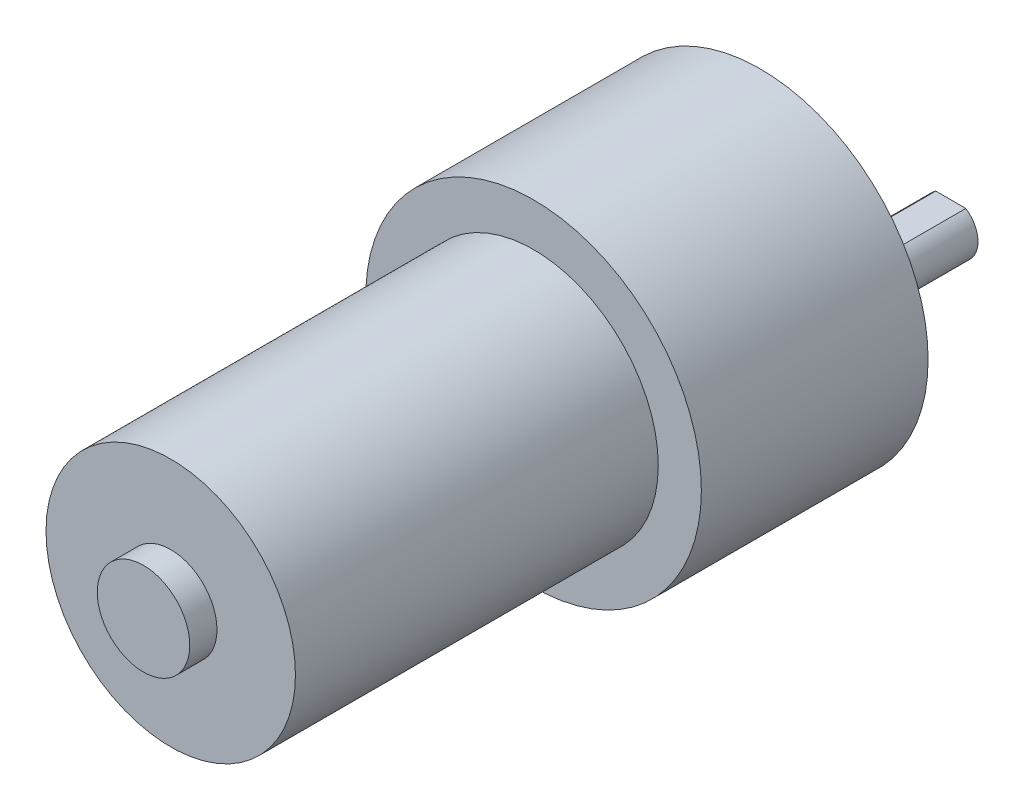
ISO-10303-21;
HEADER;
FILE_DESCRIPTION(('STEP AP214'),'2;1');
FILE_NAME('part.step','',(''),(''),'','','');
FILE_SCHEMA(('AUTOMOTIVE_DESIGN { 1 0 10303 214 1 1 1 1 }'));
ENDSEC;
DATA;
#1=APPLICATION_CONTEXT('core data for automotive mechanical design processes');
#2=APPLICATION_PROTOCOL_DEFINITION('international standard','automotive_design',2000,#1);
#3=PRODUCT_CONTEXT('',#1,'mechanical');
#4=PRODUCT('Part','Part','',(#3));
#5=PRODUCT_RELATED_PRODUCT_CATEGORY('part','',(#4));
#6=PRODUCT_DEFINITION_FORMATION('','',#4);
#7=PRODUCT_DEFINITION_CONTEXT('part definition',#1,'design');
#8=PRODUCT_DEFINITION('design','',#6,#7);
#9=PRODUCT_DEFINITION_SHAPE('','',#8);
#10=(LENGTH_UNIT() NAMED_UNIT(*) SI_UNIT(.MILLI.,.METRE.));
#11=(NAMED_UNIT(*) PLANE_ANGLE_UNIT() SI_UNIT($,.RADIAN.));
#12=(NAMED_UNIT(*) SI_UNIT($,.STERADIAN.) SOLID_ANGLE_UNIT());
#13=UNCERTAINTY_MEASURE_WITH_UNIT(LENGTH_MEASURE(1.E-05),#10,'distance_accuracy_value','');
#14=(GEOMETRIC_REPRESENTATION_CONTEXT(3) GLOBAL_UNCERTAINTY_ASSIGNED_CONTEXT((#13)) GLOBAL_UNIT_ASSIGNED_CONTEXT((#10,
#11,#12)) REPRESENTATION_CONTEXT('',''));
#15=CARTESIAN_POINT('',(0.,0.,0.));
#16=DIRECTION('',(0.,0.,1.));
#17=DIRECTION('',(1.,0.,0.));
#18=AXIS2_PLACEMENT_3D('',#15,#16,#17);
#19=CARTESIAN_POINT('',(0.,0.,65.));
#20=DIRECTION('',(0.,0.,1.));
#21=DIRECTION('',(1.,0.,0.));
#22=AXIS2_PLACEMENT_3D('',#19,#20,#21);
#23=PLANE('',#22);
#24=CARTESIAN_POINT('',(0.,0.,65.));
#25=DIRECTION('',(0.,0.,1.));
#26=DIRECTION('',(1.,0.,0.));
#27=AXIS2_PLACEMENT_3D('',#24,#25,#26);
#28=CIRCLE('',#27,13.75);
#29=CARTESIAN_POINT('',(13.75,0.,65.));
#30=VERTEX_POINT('',#29);
#31=EDGE_CURVE('E105',#30,#30,#28,.T.);
#32=ORIENTED_EDGE('',*,*,#31,.T.);
#33=EDGE_LOOP('',(#32));
#34=FACE_BOUND('',#33,.T.);
#35=CARTESIAN_POINT('',(0.,0.,65.));
#36=DIRECTION('',(0.,0.,1.));
#37=DIRECTION('',(1.,0.,0.));
#38=AXIS2_PLACEMENT_3D('',#35,#36,#37);
#39=CIRCLE('',#38,5.1);
#40=CARTESIAN_POINT('',(5.1,0.,65.));
#41=VERTEX_POINT('',#40);
#42=EDGE_CURVE('E296',#41,#41,#39,.T.);
#43=ORIENTED_EDGE('',*,*,#42,.F.);
#44=EDGE_LOOP('',(#43));
#45=FACE_BOUND('',#44,.T.);
#46=ADVANCED_FACE('F36',(#34,#45),#23,.T.);
#47=CARTESIAN_POINT('',(-40.8414213562373,0.,-6.));
#48=DIRECTION('',(0.,0.,-1.));
#49=DIRECTION('',(-1.,0.,0.));
#50=AXIS2_PLACEMENT_3D('',#47,#48,#49);
#51=PLANE('',#50);
#52=CARTESIAN_POINT('',(0.,-7.,-6.));
#53=DIRECTION('',(0.,0.,-1.));
#54=DIRECTION('',(-1.,0.,0.));
#55=AXIS2_PLACEMENT_3D('',#52,#53,#54);
#56=CIRCLE('',#55,6.);
#57=CARTESIAN_POINT('',(-6.,-7.,-6.));
#58=VERTEX_POINT('',#57);
#59=EDGE_CURVE('E78',#58,#58,#56,.T.);
#60=ORIENTED_EDGE('',*,*,#59,.T.);
#61=EDGE_LOOP('',(#60));
#62=FACE_BOUND('',#61,.T.);
#63=CARTESIAN_POINT('',(0.,-7.,-6.));
#64=DIRECTION('',(0.,0.,-1.));
#65=DIRECTION('',(-1.,0.,0.));
#66=AXIS2_PLACEMENT_3D('',#63,#64,#65);
#67=CIRCLE('',#66,3.);
#68=CARTESIAN_POINT('',(-3.,-7.,-6.));
#69=VERTEX_POINT('',#68);
#70=EDGE_CURVE('E75',#69,#69,#67,.T.);
#71=ORIENTED_EDGE('',*,*,#70,.F.);
#72=EDGE_LOOP('',(#71));
#73=FACE_BOUND('',#72,.T.);
#74=ADVANCED_FACE('F120',(#62,#73),#51,.T.);
#75=CARTESIAN_POINT('',(0.,0.,0.));
#76=DIRECTION('',(0.,0.,1.));
#77=DIRECTION('',(1.,0.,0.));
#78=AXIS2_PLACEMENT_3D('',#75,#76,#77);
#79=PLANE('',#78);
#80=CARTESIAN_POINT('',(0.,0.,0.));
#81=DIRECTION('',(0.,0.,1.));
#82=DIRECTION('',(1.,0.,0.));
#83=AXIS2_PLACEMENT_3D('',#80,#81,#82);
#84=CIRCLE('',#83,18.5);
#85=CARTESIAN_POINT('',(18.5,0.,0.));
#86=VERTEX_POINT('',#85);
#87=EDGE_CURVE('E108',#86,#86,#84,.T.);
#88=ORIENTED_EDGE('',*,*,#87,.F.);
#89=EDGE_LOOP('',(#88));
#90=FACE_BOUND('',#89,.T.);
#91=CARTESIAN_POINT('',(7.74999999999988,13.4233937586589,0.));
#92=DIRECTION('',(0.,0.,-1.));
#93=DIRECTION('',(-1.,0.,0.));
#94=AXIS2_PLACEMENT_3D('',#91,#92,#93);
#95=CIRCLE('',#94,1.5);
#96=CARTESIAN_POINT('',(6.24999999999988,13.4233937586589,0.));
#97=VERTEX_POINT('',#96);
#98=EDGE_CURVE('E96',#97,#97,#95,.T.);
#99=ORIENTED_EDGE('',*,*,#98,.F.);
#100=EDGE_LOOP('',(#99));
#101=FACE_BOUND('',#100,.T.);
#102=CARTESIAN_POINT('',(7.75000000000006,-13.4233937586588,0.));
#103=DIRECTION('',(0.,0.,-1.));
#104=DIRECTION('',(-1.,0.,0.));
#105=AXIS2_PLACEMENT_3D('',#102,#103,#104);
#106=CIRCLE('',#105,1.5);
#107=CARTESIAN_POINT('',(6.25000000000006,-13.4233937586588,0.));
#108=VERTEX_POINT('',#107);
#109=EDGE_CURVE('E90',#108,#108,#106,.T.);
#110=ORIENTED_EDGE('',*,*,#109,.F.);
#111=EDGE_LOOP('',(#110));
#112=FACE_BOUND('',#111,.T.);
#113=CARTESIAN_POINT('',(-15.5,0.,0.));
#114=DIRECTION('',(0.,0.,-1.));
#115=DIRECTION('',(-1.,0.,0.));
#116=AXIS2_PLACEMENT_3D('',#113,#114,#115);
#117=CIRCLE('',#116,1.5);
#118=CARTESIAN_POINT('',(-17.,0.,0.));
#119=VERTEX_POINT('',#118);
#120=EDGE_CURVE('E81',#119,#119,#117,.T.);
#121=ORIENTED_EDGE('',*,*,#120,.F.);
#122=EDGE_LOOP('',(#121));
#123=FACE_BOUND('',#122,.T.);
#124=CARTESIAN_POINT('',(0.,-7.,0.));
#125=DIRECTION('',(0.,0.,1.));
#126=DIRECTION('',(1.,0.,0.));
#127=AXIS2_PLACEMENT_3D('',#124,#125,#126);
#128=CIRCLE('',#127,6.);
#129=CARTESIAN_POINT('',(6.,-7.,0.));
#130=VERTEX_POINT('',#129);
#131=EDGE_CURVE('E11',#130,#130,#128,.F.);
#132=ORIENTED_EDGE('',*,*,#131,.F.);
#133=EDGE_LOOP('',(#132));
#134=FACE_BOUND('',#133,.T.);
#135=ADVANCED_FACE('F116',(#90,#101,#112,#123,#134),#79,.F.);
#136=CARTESIAN_POINT('',(0.,0.,25.));
#137=DIRECTION('',(0.,0.,1.));
#138=DIRECTION('',(1.,0.,0.));
#139=AXIS2_PLACEMENT_3D('',#136,#137,#138);
#140=PLANE('',#139);
#141=CARTESIAN_POINT('',(0.,0.,25.));
#142=DIRECTION('',(0.,0.,1.));
#143=DIRECTION('',(1.,0.,0.));
#144=AXIS2_PLACEMENT_3D('',#141,#142,#143);
#145=CIRCLE('',#144,18.5);
#146=CARTESIAN_POINT('',(18.5,0.,25.));
#147=VERTEX_POINT('',#146);
#148=EDGE_CURVE('E44',#147,#147,#145,.T.);
#149=ORIENTED_EDGE('',*,*,#148,.T.);
#150=EDGE_LOOP('',(#149));
#151=FACE_BOUND('',#150,.T.);
#152=CARTESIAN_POINT('',(0.,0.,25.));
#153=DIRECTION('',(0.,0.,1.));
#154=DIRECTION('',(1.,0.,0.));
#155=AXIS2_PLACEMENT_3D('',#152,#153,#154);
#156=CIRCLE('',#155,13.75);
#157=CARTESIAN_POINT('',(13.75,0.,25.));
#158=VERTEX_POINT('',#157);
#159=EDGE_CURVE('E102',#158,#158,#156,.T.);
#160=ORIENTED_EDGE('',*,*,#159,.F.);
#161=EDGE_LOOP('',(#160));
#162=FACE_BOUND('',#161,.T.);
#163=ADVANCED_FACE('F119',(#151,#162),#140,.T.);
#164=CARTESIAN_POINT('',(0.,0.,25.));
#165=DIRECTION('',(0.,0.,-1.));
#166=DIRECTION('',(-1.,0.,0.));
#167=AXIS2_PLACEMENT_3D('',#164,#165,#166);
#168=CYLINDRICAL_SURFACE('',#167,18.5);
#169=ORIENTED_EDGE('',*,*,#148,.F.);
#170=EDGE_LOOP('',(#169));
#171=FACE_BOUND('',#170,.T.);
#172=ORIENTED_EDGE('',*,*,#87,.T.);
#173=EDGE_LOOP('',(#172));
#174=FACE_BOUND('',#173,.T.);
#175=ADVANCED_FACE('F38',(#171,#174),#168,.T.);
#176=CARTESIAN_POINT('',(0.,0.,65.));
#177=DIRECTION('',(0.,0.,-1.));
#178=DIRECTION('',(-1.,0.,0.));
#179=AXIS2_PLACEMENT_3D('',#176,#177,#178);
#180=CYLINDRICAL_SURFACE('',#179,13.75);
#181=ORIENTED_EDGE('',*,*,#31,.F.);
#182=EDGE_LOOP('',(#181));
#183=FACE_BOUND('',#182,.T.);
#184=ORIENTED_EDGE('',*,*,#159,.T.);
#185=EDGE_LOOP('',(#184));
#186=FACE_BOUND('',#185,.T.);
#187=ADVANCED_FACE('F156',(#183,#186),#180,.T.);
#188=CARTESIAN_POINT('',(7.74999999999988,13.4233937586589,3.));
#189=DIRECTION('',(0.,0.,-1.));
#190=DIRECTION('',(-1.,0.,0.));
#191=AXIS2_PLACEMENT_3D('',#188,#189,#190);
#192=CYLINDRICAL_SURFACE('',#191,1.5);
#193=CARTESIAN_POINT('',(7.74999999999988,13.4233937586589,3.));
#194=DIRECTION('',(0.,0.,-1.));
#195=DIRECTION('',(-1.,0.,0.));
#196=AXIS2_PLACEMENT_3D('',#193,#194,#195);
#197=CIRCLE('',#196,1.5);
#198=CARTESIAN_POINT('',(6.24999999999988,13.4233937586589,3.));
#199=VERTEX_POINT('',#198);
#200=EDGE_CURVE('E99',#199,#199,#197,.T.);
#201=ORIENTED_EDGE('',*,*,#200,.F.);
#202=EDGE_LOOP('',(#201));
#203=FACE_BOUND('',#202,.T.);
#204=ORIENTED_EDGE('',*,*,#98,.T.);
#205=EDGE_LOOP('',(#204));
#206=FACE_BOUND('',#205,.T.);
#207=ADVANCED_FACE('F154',(#203,#206),#192,.F.);
#208=CARTESIAN_POINT('',(-40.8414213562373,0.,3.));
#209=DIRECTION('',(0.,0.,-1.));
#210=DIRECTION('',(-1.,0.,0.));
#211=AXIS2_PLACEMENT_3D('',#208,#209,#210);
#212=PLANE('',#211);
#213=ORIENTED_EDGE('',*,*,#200,.T.);
#214=EDGE_LOOP('',(#213));
#215=FACE_BOUND('',#214,.T.);
#216=ADVANCED_FACE('F182',(#215),#212,.T.);
#217=CARTESIAN_POINT('',(7.75000000000006,-13.4233937586588,3.));
#218=DIRECTION('',(0.,0.,-1.));
#219=DIRECTION('',(-1.,0.,0.));
#220=AXIS2_PLACEMENT_3D('',#217,#218,#219);
#221=CYLINDRICAL_SURFACE('',#220,1.5);
#222=CARTESIAN_POINT('',(7.75000000000006,-13.4233937586588,3.));
#223=DIRECTION('',(0.,0.,-1.));
#224=DIRECTION('',(-1.,0.,0.));
#225=AXIS2_PLACEMENT_3D('',#222,#223,#224);
#226=CIRCLE('',#225,1.5);
#227=CARTESIAN_POINT('',(6.25000000000006,-13.4233937586588,3.));
#228=VERTEX_POINT('',#227);
#229=EDGE_CURVE('E93',#228,#228,#226,.T.);
#230=ORIENTED_EDGE('',*,*,#229,.F.);
#231=EDGE_LOOP('',(#230));
#232=FACE_BOUND('',#231,.T.);
#233=ORIENTED_EDGE('',*,*,#109,.T.);
#234=EDGE_LOOP('',(#233));
#235=FACE_BOUND('',#234,.T.);
#236=ADVANCED_FACE('F189',(#232,#235),#221,.F.);
#237=CARTESIAN_POINT('',(-40.8414213562373,0.,3.));
#238=DIRECTION('',(0.,0.,-1.));
#239=DIRECTION('',(-1.,0.,0.));
#240=AXIS2_PLACEMENT_3D('',#237,#238,#239);
#241=PLANE('',#240);
#242=ORIENTED_EDGE('',*,*,#229,.T.);
#243=EDGE_LOOP('',(#242));
#244=FACE_BOUND('',#243,.T.);
#245=ADVANCED_FACE('F196',(#244),#241,.T.);
#246=CARTESIAN_POINT('',(-15.5,0.,3.));
#247=DIRECTION('',(0.,0.,-1.));
#248=DIRECTION('',(-1.,0.,0.));
#249=AXIS2_PLACEMENT_3D('',#246,#247,#248);
#250=CYLINDRICAL_SURFACE('',#249,1.5);
#251=CARTESIAN_POINT('',(-15.5,0.,3.));
#252=DIRECTION('',(0.,0.,-1.));
#253=DIRECTION('',(-1.,0.,0.));
#254=AXIS2_PLACEMENT_3D('',#251,#252,#253);
#255=CIRCLE('',#254,1.5);
#256=CARTESIAN_POINT('',(-17.,0.,3.));
#257=VERTEX_POINT('',#256);
#258=EDGE_CURVE('E87',#257,#257,#255,.T.);
#259=ORIENTED_EDGE('',*,*,#258,.F.);
#260=EDGE_LOOP('',(#259));
#261=FACE_BOUND('',#260,.T.);
#262=ORIENTED_EDGE('',*,*,#120,.T.);
#263=EDGE_LOOP('',(#262));
#264=FACE_BOUND('',#263,.T.);
#265=ADVANCED_FACE('F139',(#261,#264),#250,.F.);
#266=CARTESIAN_POINT('',(-40.8414213562373,0.,3.));
#267=DIRECTION('',(0.,0.,-1.));
#268=DIRECTION('',(-1.,0.,0.));
#269=AXIS2_PLACEMENT_3D('',#266,#267,#268);
#270=PLANE('',#269);
#271=ORIENTED_EDGE('',*,*,#258,.T.);
#272=EDGE_LOOP('',(#271));
#273=FACE_BOUND('',#272,.T.);
#274=ADVANCED_FACE('F131',(#273),#270,.T.);
#275=CARTESIAN_POINT('',(0.,-7.,-6.));
#276=DIRECTION('',(0.,0.,1.));
#277=DIRECTION('',(1.,0.,0.));
#278=AXIS2_PLACEMENT_3D('',#275,#276,#277);
#279=CYLINDRICAL_SURFACE('',#278,6.);
#280=ORIENTED_EDGE('',*,*,#59,.F.);
#281=EDGE_LOOP('',(#280));
#282=FACE_BOUND('',#281,.T.);
#283=ORIENTED_EDGE('',*,*,#131,.T.);
#284=EDGE_LOOP('',(#283));
#285=FACE_BOUND('',#284,.T.);
#286=ADVANCED_FACE('F129',(#282,#285),#279,.T.);
#287=CARTESIAN_POINT('',(0.,-7.,-21.));
#288=DIRECTION('',(0.,0.,1.));
#289=DIRECTION('',(1.,0.,0.));
#290=AXIS2_PLACEMENT_3D('',#287,#288,#289);
#291=CYLINDRICAL_SURFACE('',#290,3.);
#292=CARTESIAN_POINT('',(0.,-7.,-21.));
#293=DIRECTION('',(0.,0.,-1.));
#294=DIRECTION('',(-1.,0.,0.));
#295=AXIS2_PLACEMENT_3D('',#292,#293,#294);
#296=CIRCLE('',#295,3.);
#297=CARTESIAN_POINT('',(1.6583123951777,-4.5,-21.));
#298=VERTEX_POINT('',#297);
#299=CARTESIAN_POINT('',(-1.6583123951777,-4.5,-21.));
#300=VERTEX_POINT('',#299);
#301=EDGE_CURVE('E74',#298,#300,#296,.T.);
#302=ORIENTED_EDGE('',*,*,#301,.F.);
#303=DIRECTION('',(0.,0.,-1.));
#304=VECTOR('',#303,1.);
#305=CARTESIAN_POINT('',(1.6583123951777,-4.5,-9.));
#306=LINE('',#305,#304);
#307=CARTESIAN_POINT('',(1.6583123951777,-4.5,-9.));
#308=VERTEX_POINT('',#307);
#309=EDGE_CURVE('E51',#308,#298,#306,.T.);
#310=ORIENTED_EDGE('',*,*,#309,.F.);
#311=CARTESIAN_POINT('',(0.,-7.,-9.));
#312=DIRECTION('',(0.,0.,-1.));
#313=DIRECTION('',(-1.,0.,0.));
#314=AXIS2_PLACEMENT_3D('',#311,#312,#313);
#315=CIRCLE('',#314,3.);
#316=CARTESIAN_POINT('',(-1.6583123951777,-4.5,-9.));
#317=VERTEX_POINT('',#316);
#318=EDGE_CURVE('E67',#317,#308,#315,.T.);
#319=ORIENTED_EDGE('',*,*,#318,.F.);
#320=DIRECTION('',(0.,0.,-1.));
#321=VECTOR('',#320,1.);
#322=CARTESIAN_POINT('',(-1.6583123951777,-4.5,-9.));
#323=LINE('',#322,#321);
#324=EDGE_CURVE('E57',#317,#300,#323,.T.);
#325=ORIENTED_EDGE('',*,*,#324,.T.);
#326=EDGE_LOOP('',(#302,#310,#319,#325));
#327=FACE_BOUND('',#326,.T.);
#328=ORIENTED_EDGE('',*,*,#70,.T.);
#329=EDGE_LOOP('',(#328));
#330=FACE_BOUND('',#329,.T.);
#331=ADVANCED_FACE('F72',(#327,#330),#291,.T.);
#332=CARTESIAN_POINT('',(0.,-7.,-21.));
#333=DIRECTION('',(0.,0.,-1.));
#334=DIRECTION('',(-1.,0.,0.));
#335=AXIS2_PLACEMENT_3D('',#332,#333,#334);
#336=PLANE('',#335);
#337=DIRECTION('',(-1.,0.,0.));
#338=VECTOR('',#337,1.);
#339=CARTESIAN_POINT('',(-6.74142135623731,-4.5,-21.));
#340=LINE('',#339,#338);
#341=EDGE_CURVE('E62',#298,#300,#340,.T.);
#342=ORIENTED_EDGE('',*,*,#341,.F.);
#343=ORIENTED_EDGE('',*,*,#301,.T.);
#344=EDGE_LOOP('',(#342,#343));
#345=FACE_BOUND('',#344,.T.);
#346=ADVANCED_FACE('F77',(#345),#336,.T.);
#347=CARTESIAN_POINT('',(-6.74142135623731,-4.5,-9.));
#348=DIRECTION('',(0.,-1.,0.));
#349=DIRECTION('',(0.,0.,-1.));
#350=AXIS2_PLACEMENT_3D('',#347,#348,#349);
#351=PLANE('',#350);
#352=ORIENTED_EDGE('',*,*,#341,.T.);
#353=ORIENTED_EDGE('',*,*,#324,.F.);
#354=DIRECTION('',(-1.,0.,0.));
#355=VECTOR('',#354,1.);
#356=CARTESIAN_POINT('',(-6.74142135623731,-4.5,-9.));
#357=LINE('',#356,#355);
#358=EDGE_CURVE('E302',#308,#317,#357,.T.);
#359=ORIENTED_EDGE('',*,*,#358,.F.);
#360=ORIENTED_EDGE('',*,*,#309,.T.);
#361=EDGE_LOOP('',(#352,#353,#359,#360));
#362=FACE_BOUND('',#361,.T.);
#363=ADVANCED_FACE('F63',(#362),#351,.F.);
#364=CARTESIAN_POINT('',(-6.74142135623731,-7.,-9.));
#365=DIRECTION('',(0.,0.,-1.));
#366=DIRECTION('',(-1.,0.,0.));
#367=AXIS2_PLACEMENT_3D('',#364,#365,#366);
#368=PLANE('',#367);
#369=ORIENTED_EDGE('',*,*,#318,.T.);
#370=ORIENTED_EDGE('',*,*,#358,.T.);
#371=EDGE_LOOP('',(#369,#370));
#372=FACE_BOUND('',#371,.T.);
#373=ADVANCED_FACE('F257',(#372),#368,.T.);
#374=CARTESIAN_POINT('',(0.,0.,68.));
#375=DIRECTION('',(0.,0.,-1.));
#376=DIRECTION('',(-1.,0.,0.));
#377=AXIS2_PLACEMENT_3D('',#374,#375,#376);
#378=CYLINDRICAL_SURFACE('',#377,5.1);
#379=CARTESIAN_POINT('',(0.,0.,68.));
#380=DIRECTION('',(0.,0.,1.));
#381=DIRECTION('',(1.,0.,0.));
#382=AXIS2_PLACEMENT_3D('',#379,#380,#381);
#383=CIRCLE('',#382,5.1);
#384=CARTESIAN_POINT('',(5.1,0.,68.));
#385=VERTEX_POINT('',#384);
#386=EDGE_CURVE('E68',#385,#385,#383,.T.);
#387=ORIENTED_EDGE('',*,*,#386,.F.);
#388=EDGE_LOOP('',(#387));
#389=FACE_BOUND('',#388,.T.);
#390=ORIENTED_EDGE('',*,*,#42,.T.);
#391=EDGE_LOOP('',(#390));
#392=FACE_BOUND('',#391,.T.);
#393=ADVANCED_FACE('F265',(#389,#392),#378,.T.);
#394=CARTESIAN_POINT('',(0.,0.,68.));
#395=DIRECTION('',(0.,0.,1.));
#396=DIRECTION('',(1.,0.,0.));
#397=AXIS2_PLACEMENT_3D('',#394,#395,#396);
#398=PLANE('',#397);
#399=ORIENTED_EDGE('',*,*,#386,.T.);
#400=EDGE_LOOP('',(#399));
#401=FACE_BOUND('',#400,.T.);
#402=ADVANCED_FACE('F280',(#401),#398,.T.);
#403=CLOSED_SHELL('',(#46,#74,#135,#163,#175,#187,#207,#216,#236,#245,#265,#274,#286,#331,#346,
#363,#373,#393,#402));
#404=MANIFOLD_SOLID_BREP('B2',#403);
#405=ADVANCED_BREP_SHAPE_REPRESENTATION('',(#18,#404),#14);
#406=SHAPE_DEFINITION_REPRESENTATION(#9,#405);
ENDSEC;
END-ISO-10303-21;
